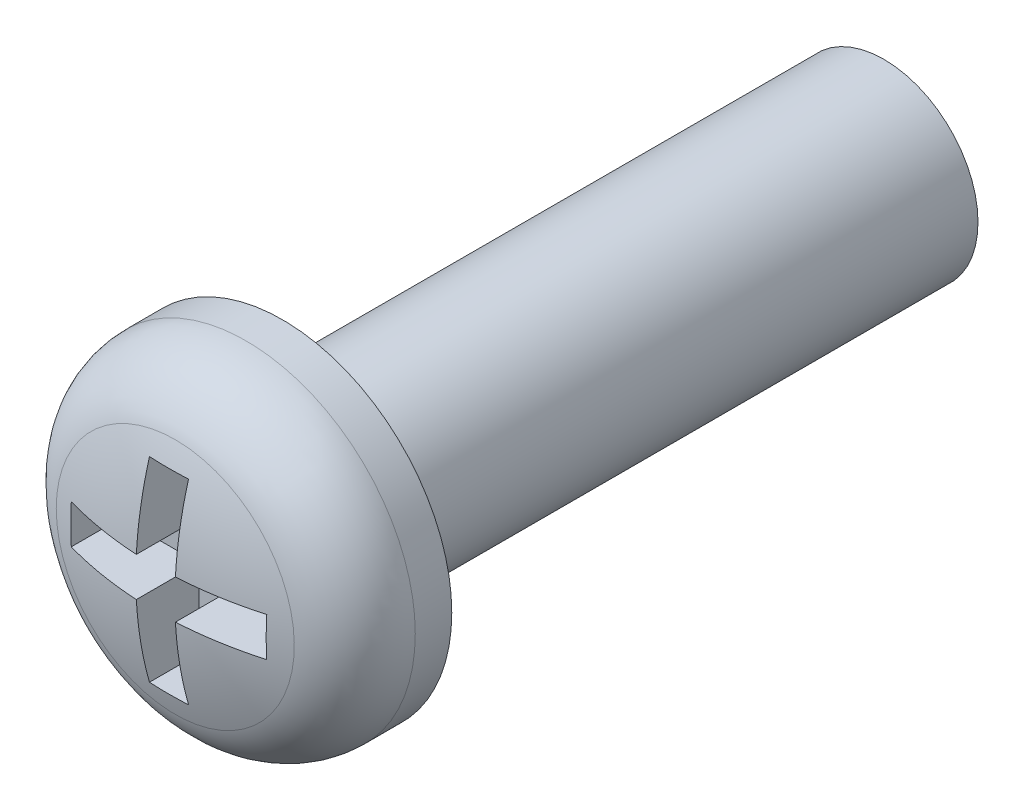
ISO-10303-21;
HEADER;
FILE_DESCRIPTION(('STEP AP214'),'2;1');
FILE_NAME('part.step','',(''),(''),'','','');
FILE_SCHEMA(('AUTOMOTIVE_DESIGN { 1 0 10303 214 1 1 1 1 }'));
ENDSEC;
DATA;
#1=APPLICATION_CONTEXT('core data for automotive mechanical design processes');
#2=APPLICATION_PROTOCOL_DEFINITION('international standard','automotive_design',2000,#1);
#3=PRODUCT_CONTEXT('',#1,'mechanical');
#4=PRODUCT('Part','Part','',(#3));
#5=PRODUCT_RELATED_PRODUCT_CATEGORY('part','',(#4));
#6=PRODUCT_DEFINITION_FORMATION('','',#4);
#7=PRODUCT_DEFINITION_CONTEXT('part definition',#1,'design');
#8=PRODUCT_DEFINITION('design','',#6,#7);
#9=PRODUCT_DEFINITION_SHAPE('','',#8);
#10=(LENGTH_UNIT() NAMED_UNIT(*) SI_UNIT(.MILLI.,.METRE.));
#11=(NAMED_UNIT(*) PLANE_ANGLE_UNIT() SI_UNIT($,.RADIAN.));
#12=(NAMED_UNIT(*) SI_UNIT($,.STERADIAN.) SOLID_ANGLE_UNIT());
#13=UNCERTAINTY_MEASURE_WITH_UNIT(LENGTH_MEASURE(1.E-05),#10,'distance_accuracy_value','');
#14=(GEOMETRIC_REPRESENTATION_CONTEXT(3) GLOBAL_UNCERTAINTY_ASSIGNED_CONTEXT((#13)) GLOBAL_UNIT_ASSIGNED_CONTEXT((#10,
#11,#12)) REPRESENTATION_CONTEXT('',''));
#15=CARTESIAN_POINT('',(0.,0.,0.));
#16=DIRECTION('',(0.,0.,1.));
#17=DIRECTION('',(1.,0.,0.));
#18=AXIS2_PLACEMENT_3D('',#15,#16,#17);
#19=CARTESIAN_POINT('',(0.,0.,-3.05024509803923));
#20=DIRECTION('',(0.,0.,1.));
#21=DIRECTION('',(0.,1.,0.));
#22=AXIS2_PLACEMENT_3D('',#19,#20,#21);
#23=SPHERICAL_SURFACE('',#22,4.75024509803923);
#24=CARTESIAN_POINT('',(0.,0.,1.42836551604378));
#25=DIRECTION('',(0.,0.,-1.));
#26=DIRECTION('',(-1.,0.,0.));
#27=AXIS2_PLACEMENT_3D('',#24,#25,#26);
#28=CIRCLE('',#27,1.58331154826482);
#29=CARTESIAN_POINT('',(-1.58331154826482,0.,1.42836551604378));
#30=VERTEX_POINT('',#29);
#31=EDGE_CURVE('E52',#30,#30,#28,.F.);
#32=ORIENTED_EDGE('',*,*,#31,.T.);
#33=EDGE_LOOP('',(#32));
#34=FACE_BOUND('',#33,.T.);
#35=CARTESIAN_POINT('',(0.259999999999999,0.,-3.05024509803923));
#36=DIRECTION('',(-1.,0.,0.));
#37=DIRECTION('',(0.,-1.,0.));
#38=AXIS2_PLACEMENT_3D('',#35,#36,#37);
#39=CIRCLE('',#38,4.74312433860275);
#40=CARTESIAN_POINT('',(0.259999999999999,0.26,1.6857477747854));
#41=VERTEX_POINT('',#40);
#42=CARTESIAN_POINT('',(0.26,1.3,1.51124900931701));
#43=VERTEX_POINT('',#42);
#44=EDGE_CURVE('E154',#41,#43,#39,.T.);
#45=ORIENTED_EDGE('',*,*,#44,.F.);
#46=CARTESIAN_POINT('',(0.,0.26,-3.05024509803923));
#47=DIRECTION('',(0.,-1.,0.));
#48=DIRECTION('',(1.,0.,0.));
#49=AXIS2_PLACEMENT_3D('',#46,#47,#48);
#50=CIRCLE('',#49,4.74312433860275);
#51=CARTESIAN_POINT('',(1.3,0.26,1.51124900931701));
#52=VERTEX_POINT('',#51);
#53=EDGE_CURVE('E67',#52,#41,#50,.T.);
#54=ORIENTED_EDGE('',*,*,#53,.F.);
#55=CARTESIAN_POINT('',(1.3,0.,-3.05024509803923));
#56=DIRECTION('',(-1.,0.,0.));
#57=DIRECTION('',(0.,-1.,0.));
#58=AXIS2_PLACEMENT_3D('',#55,#56,#57);
#59=CIRCLE('',#58,4.56889795152461);
#60=CARTESIAN_POINT('',(1.3,-0.26,1.51124900931701));
#61=VERTEX_POINT('',#60);
#62=EDGE_CURVE('E199',#61,#52,#59,.T.);
#63=ORIENTED_EDGE('',*,*,#62,.F.);
#64=CARTESIAN_POINT('',(0.,-0.259999999999999,-3.05024509803923));
#65=DIRECTION('',(0.,1.,0.));
#66=DIRECTION('',(-1.,0.,0.));
#67=AXIS2_PLACEMENT_3D('',#64,#65,#66);
#68=CIRCLE('',#67,4.74312433860275);
#69=CARTESIAN_POINT('',(0.26,-0.259999999999999,1.6857477747854));
#70=VERTEX_POINT('',#69);
#71=EDGE_CURVE('E196',#70,#61,#68,.T.);
#72=ORIENTED_EDGE('',*,*,#71,.F.);
#73=CARTESIAN_POINT('',(0.26,0.,-3.05024509803923));
#74=DIRECTION('',(-1.,0.,0.));
#75=DIRECTION('',(0.,-1.,0.));
#76=AXIS2_PLACEMENT_3D('',#73,#74,#75);
#77=CIRCLE('',#76,4.74312433860275);
#78=CARTESIAN_POINT('',(0.259999999999999,-1.3,1.51124900931701));
#79=VERTEX_POINT('',#78);
#80=EDGE_CURVE('E193',#79,#70,#77,.T.);
#81=ORIENTED_EDGE('',*,*,#80,.F.);
#82=CARTESIAN_POINT('',(0.,-1.3,-3.05024509803923));
#83=DIRECTION('',(0.,1.,0.));
#84=DIRECTION('',(-1.,0.,0.));
#85=AXIS2_PLACEMENT_3D('',#82,#83,#84);
#86=CIRCLE('',#85,4.56889795152461);
#87=CARTESIAN_POINT('',(-0.26,-1.3,1.51124900931701));
#88=VERTEX_POINT('',#87);
#89=EDGE_CURVE('E190',#88,#79,#86,.T.);
#90=ORIENTED_EDGE('',*,*,#89,.F.);
#91=CARTESIAN_POINT('',(-0.26,0.,-3.05024509803923));
#92=DIRECTION('',(1.,0.,0.));
#93=DIRECTION('',(0.,1.,0.));
#94=AXIS2_PLACEMENT_3D('',#91,#92,#93);
#95=CIRCLE('',#94,4.74312433860275);
#96=CARTESIAN_POINT('',(-0.26,-0.26,1.6857477747854));
#97=VERTEX_POINT('',#96);
#98=EDGE_CURVE('E187',#97,#88,#95,.T.);
#99=ORIENTED_EDGE('',*,*,#98,.F.);
#100=CARTESIAN_POINT('',(0.,-0.26,-3.05024509803923));
#101=DIRECTION('',(0.,1.,0.));
#102=DIRECTION('',(-1.,0.,0.));
#103=AXIS2_PLACEMENT_3D('',#100,#101,#102);
#104=CIRCLE('',#103,4.74312433860275);
#105=CARTESIAN_POINT('',(-1.3,-0.259999999999999,1.51124900931701));
#106=VERTEX_POINT('',#105);
#107=EDGE_CURVE('E184',#106,#97,#104,.T.);
#108=ORIENTED_EDGE('',*,*,#107,.F.);
#109=CARTESIAN_POINT('',(-1.3,0.,-3.05024509803923));
#110=DIRECTION('',(1.,0.,0.));
#111=DIRECTION('',(0.,1.,0.));
#112=AXIS2_PLACEMENT_3D('',#109,#110,#111);
#113=CIRCLE('',#112,4.56889795152461);
#114=CARTESIAN_POINT('',(-1.3,0.26,1.51124900931701));
#115=VERTEX_POINT('',#114);
#116=EDGE_CURVE('E181',#115,#106,#113,.T.);
#117=ORIENTED_EDGE('',*,*,#116,.F.);
#118=CARTESIAN_POINT('',(0.,0.26,-3.05024509803923));
#119=DIRECTION('',(0.,-1.,0.));
#120=DIRECTION('',(1.,0.,0.));
#121=AXIS2_PLACEMENT_3D('',#118,#119,#120);
#122=CIRCLE('',#121,4.74312433860275);
#123=CARTESIAN_POINT('',(-0.26,0.26,1.6857477747854));
#124=VERTEX_POINT('',#123);
#125=EDGE_CURVE('E178',#124,#115,#122,.T.);
#126=ORIENTED_EDGE('',*,*,#125,.F.);
#127=CARTESIAN_POINT('',(-0.26,0.,-3.05024509803923));
#128=DIRECTION('',(1.,0.,0.));
#129=DIRECTION('',(0.,1.,0.));
#130=AXIS2_PLACEMENT_3D('',#127,#128,#129);
#131=CIRCLE('',#130,4.74312433860275);
#132=CARTESIAN_POINT('',(-0.259999999999999,1.3,1.51124900931701));
#133=VERTEX_POINT('',#132);
#134=EDGE_CURVE('E175',#133,#124,#131,.T.);
#135=ORIENTED_EDGE('',*,*,#134,.F.);
#136=CARTESIAN_POINT('',(0.,1.3,-3.05024509803923));
#137=DIRECTION('',(0.,-1.,0.));
#138=DIRECTION('',(0.,0.,-1.));
#139=AXIS2_PLACEMENT_3D('',#136,#137,#138);
#140=CIRCLE('',#139,4.56889795152461);
#141=EDGE_CURVE('E172',#43,#133,#140,.T.);
#142=ORIENTED_EDGE('',*,*,#141,.F.);
#143=EDGE_LOOP('',(#45,#54,#63,#72,#81,#90,#99,#108,#117,#126,#135,#142));
#144=FACE_BOUND('',#143,.T.);
#145=ADVANCED_FACE('F43',(#34,#144),#23,.T.);
#146=CARTESIAN_POINT('',(0.,0.,33.7359697729939));
#147=DIRECTION('',(0.,0.,1.));
#148=DIRECTION('',(1.,0.,0.));
#149=AXIS2_PLACEMENT_3D('',#146,#147,#148);
#150=CYLINDRICAL_SURFACE('',#149,2.25);
#151=CARTESIAN_POINT('',(0.,0.,0.485548772560025));
#152=DIRECTION('',(0.,0.,-1.));
#153=DIRECTION('',(-1.,0.,0.));
#154=AXIS2_PLACEMENT_3D('',#151,#152,#153);
#155=CIRCLE('',#154,2.25);
#156=CARTESIAN_POINT('',(-2.25,0.,0.485548772560025));
#157=VERTEX_POINT('',#156);
#158=EDGE_CURVE('E11',#157,#157,#155,.T.);
#159=ORIENTED_EDGE('',*,*,#158,.T.);
#160=EDGE_LOOP('',(#159));
#161=FACE_BOUND('',#160,.T.);
#162=CARTESIAN_POINT('',(0.,0.,0.));
#163=DIRECTION('',(0.,0.,1.));
#164=DIRECTION('',(1.,0.,0.));
#165=AXIS2_PLACEMENT_3D('',#162,#163,#164);
#166=CIRCLE('',#165,2.25);
#167=CARTESIAN_POINT('',(2.25,0.,0.));
#168=VERTEX_POINT('',#167);
#169=EDGE_CURVE('E163',#168,#168,#166,.T.);
#170=ORIENTED_EDGE('',*,*,#169,.T.);
#171=EDGE_LOOP('',(#170));
#172=FACE_BOUND('',#171,.T.);
#173=ADVANCED_FACE('F223',(#161,#172),#150,.T.);
#174=CARTESIAN_POINT('',(0.,2.25,0.));
#175=DIRECTION('',(0.,0.,1.));
#176=DIRECTION('',(1.,0.,0.));
#177=AXIS2_PLACEMENT_3D('',#174,#175,#176);
#178=PLANE('',#177);
#179=ORIENTED_EDGE('',*,*,#169,.F.);
#180=EDGE_LOOP('',(#179));
#181=FACE_BOUND('',#180,.T.);
#182=CARTESIAN_POINT('',(0.,0.,0.));
#183=DIRECTION('',(0.,0.,1.));
#184=DIRECTION('',(1.,0.,0.));
#185=AXIS2_PLACEMENT_3D('',#182,#183,#184);
#186=CIRCLE('',#185,1.25);
#187=CARTESIAN_POINT('',(1.25,0.,0.));
#188=VERTEX_POINT('',#187);
#189=EDGE_CURVE('E157',#188,#188,#186,.T.);
#190=ORIENTED_EDGE('',*,*,#189,.T.);
#191=EDGE_LOOP('',(#190));
#192=FACE_BOUND('',#191,.T.);
#193=ADVANCED_FACE('F227',(#181,#192),#178,.F.);
#194=CARTESIAN_POINT('',(0.,0.,33.7359697729939));
#195=DIRECTION('',(0.,0.,1.));
#196=DIRECTION('',(1.,0.,0.));
#197=AXIS2_PLACEMENT_3D('',#194,#195,#196);
#198=CYLINDRICAL_SURFACE('',#197,1.25);
#199=ORIENTED_EDGE('',*,*,#189,.F.);
#200=EDGE_LOOP('',(#199));
#201=FACE_BOUND('',#200,.T.);
#202=CARTESIAN_POINT('',(0.,0.,-8.));
#203=DIRECTION('',(0.,0.,-1.));
#204=DIRECTION('',(-1.,0.,0.));
#205=AXIS2_PLACEMENT_3D('',#202,#203,#204);
#206=CIRCLE('',#205,1.25);
#207=CARTESIAN_POINT('',(-1.25,0.,-8.));
#208=VERTEX_POINT('',#207);
#209=EDGE_CURVE('E150',#208,#208,#206,.T.);
#210=ORIENTED_EDGE('',*,*,#209,.F.);
#211=EDGE_LOOP('',(#210));
#212=FACE_BOUND('',#211,.T.);
#213=ADVANCED_FACE('F233',(#201,#212),#198,.T.);
#214=CARTESIAN_POINT('',(0.259999999999999,0.26,0.85));
#215=DIRECTION('',(-1.,0.,0.));
#216=DIRECTION('',(0.,-1.,0.));
#217=AXIS2_PLACEMENT_3D('',#214,#215,#216);
#218=PLANE('',#217);
#219=ORIENTED_EDGE('',*,*,#44,.T.);
#220=DIRECTION('',(0.,0.,1.));
#221=VECTOR('',#220,1.);
#222=CARTESIAN_POINT('',(0.26,1.3,0.85));
#223=LINE('',#222,#221);
#224=CARTESIAN_POINT('',(0.26,1.3,0.85));
#225=VERTEX_POINT('',#224);
#226=EDGE_CURVE('E59',#225,#43,#223,.T.);
#227=ORIENTED_EDGE('',*,*,#226,.F.);
#228=DIRECTION('',(0.,-1.,0.));
#229=VECTOR('',#228,1.);
#230=CARTESIAN_POINT('',(0.259999999999999,0.26,0.85));
#231=LINE('',#230,#229);
#232=CARTESIAN_POINT('',(0.259999999999999,0.26,0.85));
#233=VERTEX_POINT('',#232);
#234=EDGE_CURVE('E135',#225,#233,#231,.T.);
#235=ORIENTED_EDGE('',*,*,#234,.T.);
#236=DIRECTION('',(0.,0.,1.));
#237=VECTOR('',#236,1.);
#238=CARTESIAN_POINT('',(0.259999999999999,0.26,0.85));
#239=LINE('',#238,#237);
#240=EDGE_CURVE('E158',#233,#41,#239,.T.);
#241=ORIENTED_EDGE('',*,*,#240,.T.);
#242=EDGE_LOOP('',(#219,#227,#235,#241));
#243=FACE_BOUND('',#242,.T.);
#244=ADVANCED_FACE('F152',(#243),#218,.T.);
#245=CARTESIAN_POINT('',(1.3,0.26,0.85));
#246=DIRECTION('',(0.,-1.,0.));
#247=DIRECTION('',(1.,0.,0.));
#248=AXIS2_PLACEMENT_3D('',#245,#246,#247);
#249=PLANE('',#248);
#250=ORIENTED_EDGE('',*,*,#53,.T.);
#251=ORIENTED_EDGE('',*,*,#240,.F.);
#252=DIRECTION('',(1.,0.,0.));
#253=VECTOR('',#252,1.);
#254=CARTESIAN_POINT('',(1.3,0.26,0.85));
#255=LINE('',#254,#253);
#256=CARTESIAN_POINT('',(1.3,0.26,0.85));
#257=VERTEX_POINT('',#256);
#258=EDGE_CURVE('E141',#233,#257,#255,.T.);
#259=ORIENTED_EDGE('',*,*,#258,.T.);
#260=DIRECTION('',(0.,0.,1.));
#261=VECTOR('',#260,1.);
#262=CARTESIAN_POINT('',(1.3,0.26,0.85));
#263=LINE('',#262,#261);
#264=EDGE_CURVE('E165',#257,#52,#263,.T.);
#265=ORIENTED_EDGE('',*,*,#264,.T.);
#266=EDGE_LOOP('',(#250,#251,#259,#265));
#267=FACE_BOUND('',#266,.T.);
#268=ADVANCED_FACE('F240',(#267),#249,.T.);
#269=CARTESIAN_POINT('',(1.3,-0.26,0.85));
#270=DIRECTION('',(-1.,0.,0.));
#271=DIRECTION('',(0.,-1.,0.));
#272=AXIS2_PLACEMENT_3D('',#269,#270,#271);
#273=PLANE('',#272);
#274=ORIENTED_EDGE('',*,*,#62,.T.);
#275=ORIENTED_EDGE('',*,*,#264,.F.);
#276=DIRECTION('',(0.,-1.,0.));
#277=VECTOR('',#276,1.);
#278=CARTESIAN_POINT('',(1.3,0.,0.85));
#279=LINE('',#278,#277);
#280=CARTESIAN_POINT('',(1.3,-0.26,0.85));
#281=VERTEX_POINT('',#280);
#282=EDGE_CURVE('E461',#257,#281,#279,.T.);
#283=ORIENTED_EDGE('',*,*,#282,.T.);
#284=DIRECTION('',(0.,0.,1.));
#285=VECTOR('',#284,1.);
#286=CARTESIAN_POINT('',(1.3,-0.26,0.85));
#287=LINE('',#286,#285);
#288=EDGE_CURVE('E452',#281,#61,#287,.T.);
#289=ORIENTED_EDGE('',*,*,#288,.T.);
#290=EDGE_LOOP('',(#274,#275,#283,#289));
#291=FACE_BOUND('',#290,.T.);
#292=ADVANCED_FACE('F243',(#291),#273,.T.);
#293=CARTESIAN_POINT('',(0.26,-0.259999999999999,0.85));
#294=DIRECTION('',(0.,1.,0.));
#295=DIRECTION('',(-1.,0.,0.));
#296=AXIS2_PLACEMENT_3D('',#293,#294,#295);
#297=PLANE('',#296);
#298=ORIENTED_EDGE('',*,*,#71,.T.);
#299=ORIENTED_EDGE('',*,*,#288,.F.);
#300=DIRECTION('',(-1.,0.,0.));
#301=VECTOR('',#300,1.);
#302=CARTESIAN_POINT('',(0.26,-0.259999999999999,0.85));
#303=LINE('',#302,#301);
#304=CARTESIAN_POINT('',(0.26,-0.259999999999999,0.85));
#305=VERTEX_POINT('',#304);
#306=EDGE_CURVE('E463',#281,#305,#303,.T.);
#307=ORIENTED_EDGE('',*,*,#306,.T.);
#308=DIRECTION('',(0.,0.,1.));
#309=VECTOR('',#308,1.);
#310=CARTESIAN_POINT('',(0.26,-0.259999999999999,0.85));
#311=LINE('',#310,#309);
#312=EDGE_CURVE('E448',#305,#70,#311,.T.);
#313=ORIENTED_EDGE('',*,*,#312,.T.);
#314=EDGE_LOOP('',(#298,#299,#307,#313));
#315=FACE_BOUND('',#314,.T.);
#316=ADVANCED_FACE('F246',(#315),#297,.T.);
#317=CARTESIAN_POINT('',(0.259999999999999,-1.3,0.85));
#318=DIRECTION('',(-1.,0.,0.));
#319=DIRECTION('',(0.,-1.,0.));
#320=AXIS2_PLACEMENT_3D('',#317,#318,#319);
#321=PLANE('',#320);
#322=ORIENTED_EDGE('',*,*,#80,.T.);
#323=ORIENTED_EDGE('',*,*,#312,.F.);
#324=DIRECTION('',(0.,-1.,0.));
#325=VECTOR('',#324,1.);
#326=CARTESIAN_POINT('',(0.259999999999999,-1.3,0.85));
#327=LINE('',#326,#325);
#328=CARTESIAN_POINT('',(0.259999999999999,-1.3,0.85));
#329=VERTEX_POINT('',#328);
#330=EDGE_CURVE('E467',#305,#329,#327,.T.);
#331=ORIENTED_EDGE('',*,*,#330,.T.);
#332=DIRECTION('',(0.,0.,1.));
#333=VECTOR('',#332,1.);
#334=CARTESIAN_POINT('',(0.259999999999999,-1.3,0.85));
#335=LINE('',#334,#333);
#336=EDGE_CURVE('E444',#329,#79,#335,.T.);
#337=ORIENTED_EDGE('',*,*,#336,.T.);
#338=EDGE_LOOP('',(#322,#323,#331,#337));
#339=FACE_BOUND('',#338,.T.);
#340=ADVANCED_FACE('F250',(#339),#321,.T.);
#341=CARTESIAN_POINT('',(-0.26,-1.3,0.85));
#342=DIRECTION('',(0.,1.,0.));
#343=DIRECTION('',(-1.,0.,0.));
#344=AXIS2_PLACEMENT_3D('',#341,#342,#343);
#345=PLANE('',#344);
#346=ORIENTED_EDGE('',*,*,#89,.T.);
#347=ORIENTED_EDGE('',*,*,#336,.F.);
#348=DIRECTION('',(-1.,0.,0.));
#349=VECTOR('',#348,1.);
#350=CARTESIAN_POINT('',(0.,-1.3,0.85));
#351=LINE('',#350,#349);
#352=CARTESIAN_POINT('',(-0.26,-1.3,0.85));
#353=VERTEX_POINT('',#352);
#354=EDGE_CURVE('E472',#329,#353,#351,.T.);
#355=ORIENTED_EDGE('',*,*,#354,.T.);
#356=DIRECTION('',(0.,0.,1.));
#357=VECTOR('',#356,1.);
#358=CARTESIAN_POINT('',(-0.26,-1.3,0.85));
#359=LINE('',#358,#357);
#360=EDGE_CURVE('E437',#353,#88,#359,.T.);
#361=ORIENTED_EDGE('',*,*,#360,.T.);
#362=EDGE_LOOP('',(#346,#347,#355,#361));
#363=FACE_BOUND('',#362,.T.);
#364=ADVANCED_FACE('F254',(#363),#345,.T.);
#365=CARTESIAN_POINT('',(-0.26,-0.26,0.85));
#366=DIRECTION('',(1.,0.,0.));
#367=DIRECTION('',(0.,1.,0.));
#368=AXIS2_PLACEMENT_3D('',#365,#366,#367);
#369=PLANE('',#368);
#370=ORIENTED_EDGE('',*,*,#98,.T.);
#371=ORIENTED_EDGE('',*,*,#360,.F.);
#372=DIRECTION('',(0.,1.,0.));
#373=VECTOR('',#372,1.);
#374=CARTESIAN_POINT('',(-0.26,-0.26,0.85));
#375=LINE('',#374,#373);
#376=CARTESIAN_POINT('',(-0.26,-0.26,0.85));
#377=VERTEX_POINT('',#376);
#378=EDGE_CURVE('E479',#353,#377,#375,.T.);
#379=ORIENTED_EDGE('',*,*,#378,.T.);
#380=DIRECTION('',(0.,0.,1.));
#381=VECTOR('',#380,1.);
#382=CARTESIAN_POINT('',(-0.26,-0.26,0.85));
#383=LINE('',#382,#381);
#384=EDGE_CURVE('E433',#377,#97,#383,.T.);
#385=ORIENTED_EDGE('',*,*,#384,.T.);
#386=EDGE_LOOP('',(#370,#371,#379,#385));
#387=FACE_BOUND('',#386,.T.);
#388=ADVANCED_FACE('F258',(#387),#369,.T.);
#389=CARTESIAN_POINT('',(-1.3,-0.259999999999999,0.85));
#390=DIRECTION('',(0.,1.,0.));
#391=DIRECTION('',(-1.,0.,0.));
#392=AXIS2_PLACEMENT_3D('',#389,#390,#391);
#393=PLANE('',#392);
#394=ORIENTED_EDGE('',*,*,#107,.T.);
#395=ORIENTED_EDGE('',*,*,#384,.F.);
#396=DIRECTION('',(-1.,0.,0.));
#397=VECTOR('',#396,1.);
#398=CARTESIAN_POINT('',(-1.3,-0.259999999999999,0.85));
#399=LINE('',#398,#397);
#400=CARTESIAN_POINT('',(-1.3,-0.259999999999999,0.85));
#401=VERTEX_POINT('',#400);
#402=EDGE_CURVE('E431',#377,#401,#399,.T.);
#403=ORIENTED_EDGE('',*,*,#402,.T.);
#404=DIRECTION('',(0.,0.,1.));
#405=VECTOR('',#404,1.);
#406=CARTESIAN_POINT('',(-1.3,-0.259999999999999,0.85));
#407=LINE('',#406,#405);
#408=EDGE_CURVE('E426',#401,#106,#407,.T.);
#409=ORIENTED_EDGE('',*,*,#408,.T.);
#410=EDGE_LOOP('',(#394,#395,#403,#409));
#411=FACE_BOUND('',#410,.T.);
#412=ADVANCED_FACE('F262',(#411),#393,.T.);
#413=CARTESIAN_POINT('',(-1.3,0.26,0.85));
#414=DIRECTION('',(1.,0.,0.));
#415=DIRECTION('',(0.,1.,0.));
#416=AXIS2_PLACEMENT_3D('',#413,#414,#415);
#417=PLANE('',#416);
#418=ORIENTED_EDGE('',*,*,#116,.T.);
#419=ORIENTED_EDGE('',*,*,#408,.F.);
#420=DIRECTION('',(0.,1.,0.));
#421=VECTOR('',#420,1.);
#422=CARTESIAN_POINT('',(-1.3,0.,0.85));
#423=LINE('',#422,#421);
#424=CARTESIAN_POINT('',(-1.3,0.26,0.85));
#425=VERTEX_POINT('',#424);
#426=EDGE_CURVE('E484',#401,#425,#423,.T.);
#427=ORIENTED_EDGE('',*,*,#426,.T.);
#428=DIRECTION('',(0.,0.,1.));
#429=VECTOR('',#428,1.);
#430=CARTESIAN_POINT('',(-1.3,0.26,0.85));
#431=LINE('',#430,#429);
#432=EDGE_CURVE('E419',#425,#115,#431,.T.);
#433=ORIENTED_EDGE('',*,*,#432,.T.);
#434=EDGE_LOOP('',(#418,#419,#427,#433));
#435=FACE_BOUND('',#434,.T.);
#436=ADVANCED_FACE('F266',(#435),#417,.T.);
#437=CARTESIAN_POINT('',(-0.26,0.26,0.85));
#438=DIRECTION('',(0.,-1.,0.));
#439=DIRECTION('',(1.,0.,0.));
#440=AXIS2_PLACEMENT_3D('',#437,#438,#439);
#441=PLANE('',#440);
#442=ORIENTED_EDGE('',*,*,#125,.T.);
#443=ORIENTED_EDGE('',*,*,#432,.F.);
#444=DIRECTION('',(1.,0.,0.));
#445=VECTOR('',#444,1.);
#446=CARTESIAN_POINT('',(-0.26,0.26,0.85));
#447=LINE('',#446,#445);
#448=CARTESIAN_POINT('',(-0.26,0.26,0.85));
#449=VERTEX_POINT('',#448);
#450=EDGE_CURVE('E417',#425,#449,#447,.T.);
#451=ORIENTED_EDGE('',*,*,#450,.T.);
#452=DIRECTION('',(0.,0.,1.));
#453=VECTOR('',#452,1.);
#454=CARTESIAN_POINT('',(-0.26,0.26,0.85));
#455=LINE('',#454,#453);
#456=EDGE_CURVE('E412',#449,#124,#455,.T.);
#457=ORIENTED_EDGE('',*,*,#456,.T.);
#458=EDGE_LOOP('',(#442,#443,#451,#457));
#459=FACE_BOUND('',#458,.T.);
#460=ADVANCED_FACE('F270',(#459),#441,.T.);
#461=CARTESIAN_POINT('',(-0.259999999999999,1.3,0.85));
#462=DIRECTION('',(1.,0.,0.));
#463=DIRECTION('',(0.,1.,0.));
#464=AXIS2_PLACEMENT_3D('',#461,#462,#463);
#465=PLANE('',#464);
#466=ORIENTED_EDGE('',*,*,#134,.T.);
#467=ORIENTED_EDGE('',*,*,#456,.F.);
#468=DIRECTION('',(0.,1.,0.));
#469=VECTOR('',#468,1.);
#470=CARTESIAN_POINT('',(-0.259999999999999,1.3,0.85));
#471=LINE('',#470,#469);
#472=CARTESIAN_POINT('',(-0.259999999999999,1.3,0.85));
#473=VERTEX_POINT('',#472);
#474=EDGE_CURVE('E489',#449,#473,#471,.T.);
#475=ORIENTED_EDGE('',*,*,#474,.T.);
#476=DIRECTION('',(0.,0.,1.));
#477=VECTOR('',#476,1.);
#478=CARTESIAN_POINT('',(-0.259999999999999,1.3,0.85));
#479=LINE('',#478,#477);
#480=EDGE_CURVE('E148',#473,#133,#479,.T.);
#481=ORIENTED_EDGE('',*,*,#480,.T.);
#482=EDGE_LOOP('',(#466,#467,#475,#481));
#483=FACE_BOUND('',#482,.T.);
#484=ADVANCED_FACE('F274',(#483),#465,.T.);
#485=CARTESIAN_POINT('',(0.,1.3,0.85));
#486=DIRECTION('',(0.,-1.,0.));
#487=DIRECTION('',(0.,0.,-1.));
#488=AXIS2_PLACEMENT_3D('',#485,#486,#487);
#489=PLANE('',#488);
#490=ORIENTED_EDGE('',*,*,#141,.T.);
#491=ORIENTED_EDGE('',*,*,#480,.F.);
#492=DIRECTION('',(1.,0.,0.));
#493=VECTOR('',#492,1.);
#494=CARTESIAN_POINT('',(0.26,1.3,0.85));
#495=LINE('',#494,#493);
#496=EDGE_CURVE('E138',#473,#225,#495,.T.);
#497=ORIENTED_EDGE('',*,*,#496,.T.);
#498=ORIENTED_EDGE('',*,*,#226,.T.);
#499=EDGE_LOOP('',(#490,#491,#497,#498));
#500=FACE_BOUND('',#499,.T.);
#501=ADVANCED_FACE('F146',(#500),#489,.T.);
#502=CARTESIAN_POINT('',(-0.259999999999999,1.3,0.85));
#503=DIRECTION('',(0.,0.,1.));
#504=DIRECTION('',(1.,0.,0.));
#505=AXIS2_PLACEMENT_3D('',#502,#503,#504);
#506=PLANE('',#505);
#507=ORIENTED_EDGE('',*,*,#496,.F.);
#508=ORIENTED_EDGE('',*,*,#474,.F.);
#509=ORIENTED_EDGE('',*,*,#450,.F.);
#510=ORIENTED_EDGE('',*,*,#426,.F.);
#511=ORIENTED_EDGE('',*,*,#402,.F.);
#512=ORIENTED_EDGE('',*,*,#378,.F.);
#513=ORIENTED_EDGE('',*,*,#354,.F.);
#514=ORIENTED_EDGE('',*,*,#330,.F.);
#515=ORIENTED_EDGE('',*,*,#306,.F.);
#516=ORIENTED_EDGE('',*,*,#282,.F.);
#517=ORIENTED_EDGE('',*,*,#258,.F.);
#518=ORIENTED_EDGE('',*,*,#234,.F.);
#519=EDGE_LOOP('',(#507,#508,#509,#510,#511,#512,#513,#514,#515,#516,#517,#518));
#520=FACE_BOUND('',#519,.T.);
#521=ADVANCED_FACE('F136',(#520),#506,.T.);
#522=CARTESIAN_POINT('',(0.,0.,0.485548772560026));
#523=DIRECTION('',(0.,0.,-1.));
#524=DIRECTION('',(-1.,0.,0.));
#525=AXIS2_PLACEMENT_3D('',#522,#523,#524);
#526=TOROIDAL_SURFACE('',#525,1.25,1.);
#527=ORIENTED_EDGE('',*,*,#158,.F.);
#528=EDGE_LOOP('',(#527));
#529=FACE_BOUND('',#528,.T.);
#530=ORIENTED_EDGE('',*,*,#31,.F.);
#531=EDGE_LOOP('',(#530));
#532=FACE_BOUND('',#531,.T.);
#533=ADVANCED_FACE('F45',(#529,#532),#526,.T.);
#534=CARTESIAN_POINT('',(0.,0.,-8.));
#535=DIRECTION('',(0.,0.,-1.));
#536=DIRECTION('',(-1.,0.,0.));
#537=AXIS2_PLACEMENT_3D('',#534,#535,#536);
#538=PLANE('',#537);
#539=ORIENTED_EDGE('',*,*,#209,.T.);
#540=EDGE_LOOP('',(#539));
#541=FACE_BOUND('',#540,.T.);
#542=ADVANCED_FACE('F212',(#541),#538,.T.);
#543=CLOSED_SHELL('',(#145,#173,#193,#213,#244,#268,#292,#316,#340,#364,#388,#412,#436,#460,
#484,#501,#521,#533,#542));
#544=MANIFOLD_SOLID_BREP('B2',#543);
#545=ADVANCED_BREP_SHAPE_REPRESENTATION('',(#18,#544),#14);
#546=SHAPE_DEFINITION_REPRESENTATION(#9,#545);
ENDSEC;
END-ISO-10303-21;
